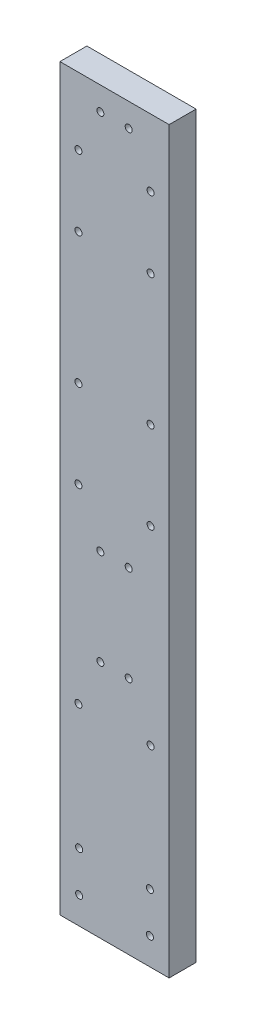
ISO-10303-21;
HEADER;
FILE_DESCRIPTION(('STEP AP214'),'2;1');
FILE_NAME('part.step','',(''),(''),'','','');
FILE_SCHEMA(('AUTOMOTIVE_DESIGN { 1 0 10303 214 1 1 1 1 }'));
ENDSEC;
DATA;
#1=APPLICATION_CONTEXT('core data for automotive mechanical design processes');
#2=APPLICATION_PROTOCOL_DEFINITION('international standard','automotive_design',2000,#1);
#3=PRODUCT_CONTEXT('',#1,'mechanical');
#4=PRODUCT('Part','Part','',(#3));
#5=PRODUCT_RELATED_PRODUCT_CATEGORY('part','',(#4));
#6=PRODUCT_DEFINITION_FORMATION('','',#4);
#7=PRODUCT_DEFINITION_CONTEXT('part definition',#1,'design');
#8=PRODUCT_DEFINITION('design','',#6,#7);
#9=PRODUCT_DEFINITION_SHAPE('','',#8);
#10=(LENGTH_UNIT() NAMED_UNIT(*) SI_UNIT(.MILLI.,.METRE.));
#11=(NAMED_UNIT(*) PLANE_ANGLE_UNIT() SI_UNIT($,.RADIAN.));
#12=(NAMED_UNIT(*) SI_UNIT($,.STERADIAN.) SOLID_ANGLE_UNIT());
#13=UNCERTAINTY_MEASURE_WITH_UNIT(LENGTH_MEASURE(1.E-05),#10,'distance_accuracy_value','');
#14=(GEOMETRIC_REPRESENTATION_CONTEXT(3) GLOBAL_UNCERTAINTY_ASSIGNED_CONTEXT((#13)) GLOBAL_UNIT_ASSIGNED_CONTEXT((#10,
#11,#12)) REPRESENTATION_CONTEXT('',''));
#15=CARTESIAN_POINT('',(0.,0.,0.));
#16=DIRECTION('',(0.,0.,1.));
#17=DIRECTION('',(1.,0.,0.));
#18=AXIS2_PLACEMENT_3D('',#15,#16,#17);
#19=CARTESIAN_POINT('',(0.,0.,4.));
#20=DIRECTION('',(0.,0.,1.));
#21=DIRECTION('',(1.,0.,0.));
#22=AXIS2_PLACEMENT_3D('',#19,#20,#21);
#23=PLANE('',#22);
#24=CARTESIAN_POINT('',(13.35,10.,4.));
#25=DIRECTION('',(0.,0.,1.));
#26=DIRECTION('',(-1.,0.,0.));
#27=AXIS2_PLACEMENT_3D('',#24,#25,#26);
#28=CIRCLE('',#27,0.519960121099866);
#29=CARTESIAN_POINT('',(12.8300398789001,10.,4.));
#30=VERTEX_POINT('',#29);
#31=EDGE_CURVE('E217',#30,#30,#28,.T.);
#32=ORIENTED_EDGE('',*,*,#31,.F.);
#33=EDGE_LOOP('',(#32));
#34=FACE_BOUND('',#33,.T.);
#35=CARTESIAN_POINT('',(2.85,10.,4.));
#36=DIRECTION('',(0.,0.,1.));
#37=DIRECTION('',(1.,0.,0.));
#38=AXIS2_PLACEMENT_3D('',#35,#36,#37);
#39=CIRCLE('',#38,0.519960121099865);
#40=CARTESIAN_POINT('',(3.36996012109986,10.,4.));
#41=VERTEX_POINT('',#40);
#42=EDGE_CURVE('E205',#41,#41,#39,.T.);
#43=ORIENTED_EDGE('',*,*,#42,.F.);
#44=EDGE_LOOP('',(#43));
#45=FACE_BOUND('',#44,.T.);
#46=CARTESIAN_POINT('',(2.74999999999998,69.71,4.));
#47=DIRECTION('',(0.,0.,1.));
#48=DIRECTION('',(1.,0.,0.));
#49=AXIS2_PLACEMENT_3D('',#46,#47,#48);
#50=CIRCLE('',#49,0.519960121099858);
#51=CARTESIAN_POINT('',(3.26996012109984,69.71,4.));
#52=VERTEX_POINT('',#51);
#53=EDGE_CURVE('E193',#52,#52,#50,.T.);
#54=ORIENTED_EDGE('',*,*,#53,.F.);
#55=EDGE_LOOP('',(#54));
#56=FACE_BOUND('',#55,.T.);
#57=CARTESIAN_POINT('',(2.74999999999999,56.71,4.));
#58=DIRECTION('',(0.,0.,1.));
#59=DIRECTION('',(1.,0.,0.));
#60=AXIS2_PLACEMENT_3D('',#57,#58,#59);
#61=CIRCLE('',#60,0.519960121099858);
#62=CARTESIAN_POINT('',(3.26996012109985,56.71,4.));
#63=VERTEX_POINT('',#62);
#64=EDGE_CURVE('E181',#63,#63,#61,.T.);
#65=ORIENTED_EDGE('',*,*,#64,.F.);
#66=EDGE_LOOP('',(#65));
#67=FACE_BOUND('',#66,.T.);
#68=CARTESIAN_POINT('',(10.2,106.16,4.));
#69=DIRECTION('',(0.,0.,1.));
#70=DIRECTION('',(-1.,0.,0.));
#71=AXIS2_PLACEMENT_3D('',#68,#69,#70);
#72=CIRCLE('',#71,0.519960121099869);
#73=CARTESIAN_POINT('',(9.68003987890012,106.16,4.));
#74=VERTEX_POINT('',#73);
#75=EDGE_CURVE('E169',#74,#74,#72,.T.);
#76=ORIENTED_EDGE('',*,*,#75,.F.);
#77=EDGE_LOOP('',(#76));
#78=FACE_BOUND('',#77,.T.);
#79=CARTESIAN_POINT('',(2.74999999999998,89.16,4.));
#80=DIRECTION('',(0.,0.,1.));
#81=DIRECTION('',(-1.,0.,0.));
#82=AXIS2_PLACEMENT_3D('',#79,#80,#81);
#83=CIRCLE('',#82,0.51996012109986);
#84=CARTESIAN_POINT('',(2.23003987890013,89.16,4.));
#85=VERTEX_POINT('',#84);
#86=EDGE_CURVE('E157',#85,#85,#83,.T.);
#87=ORIENTED_EDGE('',*,*,#86,.F.);
#88=EDGE_LOOP('',(#87));
#89=FACE_BOUND('',#88,.T.);
#90=CARTESIAN_POINT('',(2.75,28.5,4.));
#91=DIRECTION('',(0.,0.,1.));
#92=DIRECTION('',(1.,0.,0.));
#93=AXIS2_PLACEMENT_3D('',#90,#91,#92);
#94=CIRCLE('',#93,0.519960121099867);
#95=CARTESIAN_POINT('',(3.26996012109986,28.5,4.));
#96=VERTEX_POINT('',#95);
#97=EDGE_CURVE('E145',#96,#96,#94,.T.);
#98=ORIENTED_EDGE('',*,*,#97,.F.);
#99=EDGE_LOOP('',(#98));
#100=FACE_BOUND('',#99,.T.);
#101=CARTESIAN_POINT('',(6.,35.5,4.));
#102=DIRECTION('',(0.,0.,1.));
#103=DIRECTION('',(1.,0.,0.));
#104=AXIS2_PLACEMENT_3D('',#101,#102,#103);
#105=CIRCLE('',#104,0.51996012109988);
#106=CARTESIAN_POINT('',(6.51996012109988,35.5,4.));
#107=VERTEX_POINT('',#106);
#108=EDGE_CURVE('E133',#107,#107,#105,.T.);
#109=ORIENTED_EDGE('',*,*,#108,.F.);
#110=EDGE_LOOP('',(#109));
#111=FACE_BOUND('',#110,.T.);
#112=CARTESIAN_POINT('',(5.99999999999999,49.71,4.));
#113=DIRECTION('',(0.,0.,1.));
#114=DIRECTION('',(1.,0.,0.));
#115=AXIS2_PLACEMENT_3D('',#112,#113,#114);
#116=CIRCLE('',#115,0.519960121099861);
#117=CARTESIAN_POINT('',(6.51996012109985,49.71,4.));
#118=VERTEX_POINT('',#117);
#119=EDGE_CURVE('E121',#118,#118,#116,.T.);
#120=ORIENTED_EDGE('',*,*,#119,.F.);
#121=EDGE_LOOP('',(#120));
#122=FACE_BOUND('',#121,.T.);
#123=CARTESIAN_POINT('',(5.99999999999999,106.16,4.));
#124=DIRECTION('',(0.,0.,1.));
#125=DIRECTION('',(1.,0.,0.));
#126=AXIS2_PLACEMENT_3D('',#123,#124,#125);
#127=CIRCLE('',#126,0.519960121099861);
#128=CARTESIAN_POINT('',(6.51996012109985,106.16,4.));
#129=VERTEX_POINT('',#128);
#130=EDGE_CURVE('E100',#129,#129,#127,.T.);
#131=ORIENTED_EDGE('',*,*,#130,.F.);
#132=EDGE_LOOP('',(#131));
#133=FACE_BOUND('',#132,.T.);
#134=DIRECTION('',(0.,-1.,0.));
#135=VECTOR('',#134,1.);
#136=CARTESIAN_POINT('',(0.,109.64,4.));
#137=LINE('',#136,#135);
#138=CARTESIAN_POINT('',(0.,109.64,4.));
#139=VERTEX_POINT('',#138);
#140=CARTESIAN_POINT('',(0.,0.,4.));
#141=VERTEX_POINT('',#140);
#142=EDGE_CURVE('E85',#139,#141,#137,.T.);
#143=ORIENTED_EDGE('',*,*,#142,.T.);
#144=DIRECTION('',(1.,0.,0.));
#145=VECTOR('',#144,1.);
#146=CARTESIAN_POINT('',(0.,0.,4.));
#147=LINE('',#146,#145);
#148=CARTESIAN_POINT('',(16.2,0.,4.));
#149=VERTEX_POINT('',#148);
#150=EDGE_CURVE('E80',#141,#149,#147,.T.);
#151=ORIENTED_EDGE('',*,*,#150,.T.);
#152=DIRECTION('',(0.,1.,0.));
#153=VECTOR('',#152,1.);
#154=CARTESIAN_POINT('',(16.2,0.,4.));
#155=LINE('',#154,#153);
#156=CARTESIAN_POINT('',(16.2,109.64,4.));
#157=VERTEX_POINT('',#156);
#158=EDGE_CURVE('E83',#149,#157,#155,.T.);
#159=ORIENTED_EDGE('',*,*,#158,.T.);
#160=DIRECTION('',(-1.,0.,0.));
#161=VECTOR('',#160,1.);
#162=CARTESIAN_POINT('',(16.2,109.64,4.));
#163=LINE('',#162,#161);
#164=EDGE_CURVE('E50',#157,#139,#163,.T.);
#165=ORIENTED_EDGE('',*,*,#164,.T.);
#166=EDGE_LOOP('',(#143,#151,#159,#165));
#167=FACE_BOUND('',#166,.T.);
#168=CARTESIAN_POINT('',(10.2,49.71,4.));
#169=DIRECTION('',(0.,0.,1.));
#170=DIRECTION('',(1.,0.,0.));
#171=AXIS2_PLACEMENT_3D('',#168,#169,#170);
#172=CIRCLE('',#171,0.519960121099864);
#173=CARTESIAN_POINT('',(10.7199601210999,49.71,4.));
#174=VERTEX_POINT('',#173);
#175=EDGE_CURVE('E115',#174,#174,#172,.T.);
#176=ORIENTED_EDGE('',*,*,#175,.F.);
#177=EDGE_LOOP('',(#176));
#178=FACE_BOUND('',#177,.T.);
#179=CARTESIAN_POINT('',(10.2,35.5,4.));
#180=DIRECTION('',(0.,0.,1.));
#181=DIRECTION('',(1.,0.,0.));
#182=AXIS2_PLACEMENT_3D('',#179,#180,#181);
#183=CIRCLE('',#182,0.519960121099865);
#184=CARTESIAN_POINT('',(10.7199601210999,35.5,4.));
#185=VERTEX_POINT('',#184);
#186=EDGE_CURVE('E127',#185,#185,#183,.T.);
#187=ORIENTED_EDGE('',*,*,#186,.F.);
#188=EDGE_LOOP('',(#187));
#189=FACE_BOUND('',#188,.T.);
#190=CARTESIAN_POINT('',(13.45,28.5,4.));
#191=DIRECTION('',(0.,0.,1.));
#192=DIRECTION('',(1.,0.,0.));
#193=AXIS2_PLACEMENT_3D('',#190,#191,#192);
#194=CIRCLE('',#193,0.519960121099865);
#195=CARTESIAN_POINT('',(13.9699601210999,28.5,4.));
#196=VERTEX_POINT('',#195);
#197=EDGE_CURVE('E139',#196,#196,#194,.T.);
#198=ORIENTED_EDGE('',*,*,#197,.F.);
#199=EDGE_LOOP('',(#198));
#200=FACE_BOUND('',#199,.T.);
#201=CARTESIAN_POINT('',(13.45,56.71,4.));
#202=DIRECTION('',(0.,0.,1.));
#203=DIRECTION('',(1.,0.,0.));
#204=AXIS2_PLACEMENT_3D('',#201,#202,#203);
#205=CIRCLE('',#204,0.519960121099861);
#206=CARTESIAN_POINT('',(13.9699601210999,56.71,4.));
#207=VERTEX_POINT('',#206);
#208=EDGE_CURVE('E151',#207,#207,#205,.T.);
#209=ORIENTED_EDGE('',*,*,#208,.F.);
#210=EDGE_LOOP('',(#209));
#211=FACE_BOUND('',#210,.T.);
#212=CARTESIAN_POINT('',(13.45,89.16,4.));
#213=DIRECTION('',(0.,0.,1.));
#214=DIRECTION('',(-1.,0.,0.));
#215=AXIS2_PLACEMENT_3D('',#212,#213,#214);
#216=CIRCLE('',#215,0.519960121099861);
#217=CARTESIAN_POINT('',(12.9300398789001,89.16,4.));
#218=VERTEX_POINT('',#217);
#219=EDGE_CURVE('E163',#218,#218,#216,.T.);
#220=ORIENTED_EDGE('',*,*,#219,.F.);
#221=EDGE_LOOP('',(#220));
#222=FACE_BOUND('',#221,.T.);
#223=CARTESIAN_POINT('',(13.45,99.66,4.));
#224=DIRECTION('',(0.,0.,1.));
#225=DIRECTION('',(-1.,0.,0.));
#226=AXIS2_PLACEMENT_3D('',#223,#224,#225);
#227=CIRCLE('',#226,0.519960121099862);
#228=CARTESIAN_POINT('',(12.9300398789001,99.66,4.));
#229=VERTEX_POINT('',#228);
#230=EDGE_CURVE('E175',#229,#229,#227,.T.);
#231=ORIENTED_EDGE('',*,*,#230,.F.);
#232=EDGE_LOOP('',(#231));
#233=FACE_BOUND('',#232,.T.);
#234=CARTESIAN_POINT('',(13.45,69.71,4.));
#235=DIRECTION('',(0.,0.,1.));
#236=DIRECTION('',(1.,0.,0.));
#237=AXIS2_PLACEMENT_3D('',#234,#235,#236);
#238=CIRCLE('',#237,0.519960121099861);
#239=CARTESIAN_POINT('',(13.9699601210999,69.71,4.));
#240=VERTEX_POINT('',#239);
#241=EDGE_CURVE('E187',#240,#240,#238,.T.);
#242=ORIENTED_EDGE('',*,*,#241,.F.);
#243=EDGE_LOOP('',(#242));
#244=FACE_BOUND('',#243,.T.);
#245=CARTESIAN_POINT('',(2.74999999999999,99.66,4.));
#246=DIRECTION('',(0.,0.,1.));
#247=DIRECTION('',(1.,0.,0.));
#248=AXIS2_PLACEMENT_3D('',#245,#246,#247);
#249=CIRCLE('',#248,0.51996012109986);
#250=CARTESIAN_POINT('',(3.26996012109985,99.66,4.));
#251=VERTEX_POINT('',#250);
#252=EDGE_CURVE('E199',#251,#251,#249,.T.);
#253=ORIENTED_EDGE('',*,*,#252,.F.);
#254=EDGE_LOOP('',(#253));
#255=FACE_BOUND('',#254,.T.);
#256=CARTESIAN_POINT('',(2.85,4.,4.));
#257=DIRECTION('',(0.,0.,1.));
#258=DIRECTION('',(1.,0.,0.));
#259=AXIS2_PLACEMENT_3D('',#256,#257,#258);
#260=CIRCLE('',#259,0.519960121099865);
#261=CARTESIAN_POINT('',(3.36996012109986,4.,4.));
#262=VERTEX_POINT('',#261);
#263=EDGE_CURVE('E211',#262,#262,#260,.T.);
#264=ORIENTED_EDGE('',*,*,#263,.F.);
#265=EDGE_LOOP('',(#264));
#266=FACE_BOUND('',#265,.T.);
#267=CARTESIAN_POINT('',(13.35,4.,4.));
#268=DIRECTION('',(0.,0.,1.));
#269=DIRECTION('',(-1.,0.,0.));
#270=AXIS2_PLACEMENT_3D('',#267,#268,#269);
#271=CIRCLE('',#270,0.519960121099866);
#272=CARTESIAN_POINT('',(12.8300398789001,4.,4.));
#273=VERTEX_POINT('',#272);
#274=EDGE_CURVE('E223',#273,#273,#271,.T.);
#275=ORIENTED_EDGE('',*,*,#274,.F.);
#276=EDGE_LOOP('',(#275));
#277=FACE_BOUND('',#276,.T.);
#278=ADVANCED_FACE('F33',(#34,#45,#56,#67,#78,#89,#100,#111,#122,#133,#167,#178,#189,#200,#211,
#222,#233,#244,#255,#266,#277),#23,.T.);
#279=CARTESIAN_POINT('',(0.,0.,0.));
#280=DIRECTION('',(0.,0.,1.));
#281=DIRECTION('',(1.,0.,0.));
#282=AXIS2_PLACEMENT_3D('',#279,#280,#281);
#283=PLANE('',#282);
#284=CARTESIAN_POINT('',(13.35,10.,0.));
#285=DIRECTION('',(0.,0.,1.));
#286=DIRECTION('',(-1.,0.,0.));
#287=AXIS2_PLACEMENT_3D('',#284,#285,#286);
#288=CIRCLE('',#287,0.519960121099866);
#289=CARTESIAN_POINT('',(12.8300398789001,10.,0.));
#290=VERTEX_POINT('',#289);
#291=EDGE_CURVE('E220',#290,#290,#288,.T.);
#292=ORIENTED_EDGE('',*,*,#291,.T.);
#293=EDGE_LOOP('',(#292));
#294=FACE_BOUND('',#293,.T.);
#295=CARTESIAN_POINT('',(2.85,10.,0.));
#296=DIRECTION('',(0.,0.,1.));
#297=DIRECTION('',(1.,0.,0.));
#298=AXIS2_PLACEMENT_3D('',#295,#296,#297);
#299=CIRCLE('',#298,0.519960121099865);
#300=CARTESIAN_POINT('',(3.36996012109986,10.,0.));
#301=VERTEX_POINT('',#300);
#302=EDGE_CURVE('E208',#301,#301,#299,.T.);
#303=ORIENTED_EDGE('',*,*,#302,.T.);
#304=EDGE_LOOP('',(#303));
#305=FACE_BOUND('',#304,.T.);
#306=CARTESIAN_POINT('',(2.74999999999998,69.71,0.));
#307=DIRECTION('',(0.,0.,1.));
#308=DIRECTION('',(1.,0.,0.));
#309=AXIS2_PLACEMENT_3D('',#306,#307,#308);
#310=CIRCLE('',#309,0.519960121099858);
#311=CARTESIAN_POINT('',(3.26996012109984,69.71,0.));
#312=VERTEX_POINT('',#311);
#313=EDGE_CURVE('E196',#312,#312,#310,.T.);
#314=ORIENTED_EDGE('',*,*,#313,.T.);
#315=EDGE_LOOP('',(#314));
#316=FACE_BOUND('',#315,.T.);
#317=CARTESIAN_POINT('',(2.74999999999999,56.71,0.));
#318=DIRECTION('',(0.,0.,1.));
#319=DIRECTION('',(1.,0.,0.));
#320=AXIS2_PLACEMENT_3D('',#317,#318,#319);
#321=CIRCLE('',#320,0.519960121099858);
#322=CARTESIAN_POINT('',(3.26996012109985,56.71,0.));
#323=VERTEX_POINT('',#322);
#324=EDGE_CURVE('E184',#323,#323,#321,.T.);
#325=ORIENTED_EDGE('',*,*,#324,.T.);
#326=EDGE_LOOP('',(#325));
#327=FACE_BOUND('',#326,.T.);
#328=CARTESIAN_POINT('',(10.2,106.16,0.));
#329=DIRECTION('',(0.,0.,1.));
#330=DIRECTION('',(-1.,0.,0.));
#331=AXIS2_PLACEMENT_3D('',#328,#329,#330);
#332=CIRCLE('',#331,0.519960121099869);
#333=CARTESIAN_POINT('',(9.68003987890012,106.16,0.));
#334=VERTEX_POINT('',#333);
#335=EDGE_CURVE('E172',#334,#334,#332,.T.);
#336=ORIENTED_EDGE('',*,*,#335,.T.);
#337=EDGE_LOOP('',(#336));
#338=FACE_BOUND('',#337,.T.);
#339=CARTESIAN_POINT('',(2.74999999999998,89.16,0.));
#340=DIRECTION('',(0.,0.,1.));
#341=DIRECTION('',(-1.,0.,0.));
#342=AXIS2_PLACEMENT_3D('',#339,#340,#341);
#343=CIRCLE('',#342,0.51996012109986);
#344=CARTESIAN_POINT('',(2.23003987890013,89.16,0.));
#345=VERTEX_POINT('',#344);
#346=EDGE_CURVE('E160',#345,#345,#343,.T.);
#347=ORIENTED_EDGE('',*,*,#346,.T.);
#348=EDGE_LOOP('',(#347));
#349=FACE_BOUND('',#348,.T.);
#350=CARTESIAN_POINT('',(2.75,28.5,0.));
#351=DIRECTION('',(0.,0.,1.));
#352=DIRECTION('',(1.,0.,0.));
#353=AXIS2_PLACEMENT_3D('',#350,#351,#352);
#354=CIRCLE('',#353,0.519960121099867);
#355=CARTESIAN_POINT('',(3.26996012109986,28.5,0.));
#356=VERTEX_POINT('',#355);
#357=EDGE_CURVE('E148',#356,#356,#354,.T.);
#358=ORIENTED_EDGE('',*,*,#357,.T.);
#359=EDGE_LOOP('',(#358));
#360=FACE_BOUND('',#359,.T.);
#361=CARTESIAN_POINT('',(6.,35.5,0.));
#362=DIRECTION('',(0.,0.,1.));
#363=DIRECTION('',(1.,0.,0.));
#364=AXIS2_PLACEMENT_3D('',#361,#362,#363);
#365=CIRCLE('',#364,0.51996012109988);
#366=CARTESIAN_POINT('',(6.51996012109988,35.5,0.));
#367=VERTEX_POINT('',#366);
#368=EDGE_CURVE('E136',#367,#367,#365,.T.);
#369=ORIENTED_EDGE('',*,*,#368,.T.);
#370=EDGE_LOOP('',(#369));
#371=FACE_BOUND('',#370,.T.);
#372=CARTESIAN_POINT('',(5.99999999999999,49.71,0.));
#373=DIRECTION('',(0.,0.,1.));
#374=DIRECTION('',(1.,0.,0.));
#375=AXIS2_PLACEMENT_3D('',#372,#373,#374);
#376=CIRCLE('',#375,0.519960121099861);
#377=CARTESIAN_POINT('',(6.51996012109985,49.71,0.));
#378=VERTEX_POINT('',#377);
#379=EDGE_CURVE('E124',#378,#378,#376,.T.);
#380=ORIENTED_EDGE('',*,*,#379,.T.);
#381=EDGE_LOOP('',(#380));
#382=FACE_BOUND('',#381,.T.);
#383=CARTESIAN_POINT('',(5.99999999999999,106.16,0.));
#384=DIRECTION('',(0.,0.,1.));
#385=DIRECTION('',(1.,0.,0.));
#386=AXIS2_PLACEMENT_3D('',#383,#384,#385);
#387=CIRCLE('',#386,0.519960121099861);
#388=CARTESIAN_POINT('',(6.51996012109985,106.16,0.));
#389=VERTEX_POINT('',#388);
#390=EDGE_CURVE('E112',#389,#389,#387,.T.);
#391=ORIENTED_EDGE('',*,*,#390,.T.);
#392=EDGE_LOOP('',(#391));
#393=FACE_BOUND('',#392,.T.);
#394=DIRECTION('',(0.,-1.,0.));
#395=VECTOR('',#394,1.);
#396=CARTESIAN_POINT('',(0.,109.64,0.));
#397=LINE('',#396,#395);
#398=CARTESIAN_POINT('',(0.,109.64,0.));
#399=VERTEX_POINT('',#398);
#400=CARTESIAN_POINT('',(0.,0.,0.));
#401=VERTEX_POINT('',#400);
#402=EDGE_CURVE('E97',#399,#401,#397,.T.);
#403=ORIENTED_EDGE('',*,*,#402,.F.);
#404=DIRECTION('',(-1.,0.,0.));
#405=VECTOR('',#404,1.);
#406=CARTESIAN_POINT('',(16.2,109.64,0.));
#407=LINE('',#406,#405);
#408=CARTESIAN_POINT('',(16.2,109.64,0.));
#409=VERTEX_POINT('',#408);
#410=EDGE_CURVE('E73',#409,#399,#407,.T.);
#411=ORIENTED_EDGE('',*,*,#410,.F.);
#412=DIRECTION('',(0.,1.,0.));
#413=VECTOR('',#412,1.);
#414=CARTESIAN_POINT('',(16.2,0.,0.));
#415=LINE('',#414,#413);
#416=CARTESIAN_POINT('',(16.2,0.,0.));
#417=VERTEX_POINT('',#416);
#418=EDGE_CURVE('E67',#417,#409,#415,.T.);
#419=ORIENTED_EDGE('',*,*,#418,.F.);
#420=DIRECTION('',(1.,0.,0.));
#421=VECTOR('',#420,1.);
#422=CARTESIAN_POINT('',(0.,0.,0.));
#423=LINE('',#422,#421);
#424=EDGE_CURVE('E89',#401,#417,#423,.T.);
#425=ORIENTED_EDGE('',*,*,#424,.F.);
#426=EDGE_LOOP('',(#403,#411,#419,#425));
#427=FACE_BOUND('',#426,.T.);
#428=CARTESIAN_POINT('',(10.2,49.71,0.));
#429=DIRECTION('',(0.,0.,1.));
#430=DIRECTION('',(1.,0.,0.));
#431=AXIS2_PLACEMENT_3D('',#428,#429,#430);
#432=CIRCLE('',#431,0.519960121099864);
#433=CARTESIAN_POINT('',(10.7199601210999,49.71,0.));
#434=VERTEX_POINT('',#433);
#435=EDGE_CURVE('E118',#434,#434,#432,.T.);
#436=ORIENTED_EDGE('',*,*,#435,.T.);
#437=EDGE_LOOP('',(#436));
#438=FACE_BOUND('',#437,.T.);
#439=CARTESIAN_POINT('',(10.2,35.5,0.));
#440=DIRECTION('',(0.,0.,1.));
#441=DIRECTION('',(1.,0.,0.));
#442=AXIS2_PLACEMENT_3D('',#439,#440,#441);
#443=CIRCLE('',#442,0.519960121099865);
#444=CARTESIAN_POINT('',(10.7199601210999,35.5,0.));
#445=VERTEX_POINT('',#444);
#446=EDGE_CURVE('E130',#445,#445,#443,.T.);
#447=ORIENTED_EDGE('',*,*,#446,.T.);
#448=EDGE_LOOP('',(#447));
#449=FACE_BOUND('',#448,.T.);
#450=CARTESIAN_POINT('',(13.45,28.5,0.));
#451=DIRECTION('',(0.,0.,1.));
#452=DIRECTION('',(1.,0.,0.));
#453=AXIS2_PLACEMENT_3D('',#450,#451,#452);
#454=CIRCLE('',#453,0.519960121099865);
#455=CARTESIAN_POINT('',(13.9699601210999,28.5,0.));
#456=VERTEX_POINT('',#455);
#457=EDGE_CURVE('E142',#456,#456,#454,.T.);
#458=ORIENTED_EDGE('',*,*,#457,.T.);
#459=EDGE_LOOP('',(#458));
#460=FACE_BOUND('',#459,.T.);
#461=CARTESIAN_POINT('',(13.45,56.71,0.));
#462=DIRECTION('',(0.,0.,1.));
#463=DIRECTION('',(1.,0.,0.));
#464=AXIS2_PLACEMENT_3D('',#461,#462,#463);
#465=CIRCLE('',#464,0.519960121099861);
#466=CARTESIAN_POINT('',(13.9699601210999,56.71,0.));
#467=VERTEX_POINT('',#466);
#468=EDGE_CURVE('E154',#467,#467,#465,.T.);
#469=ORIENTED_EDGE('',*,*,#468,.T.);
#470=EDGE_LOOP('',(#469));
#471=FACE_BOUND('',#470,.T.);
#472=CARTESIAN_POINT('',(13.45,89.16,0.));
#473=DIRECTION('',(0.,0.,1.));
#474=DIRECTION('',(-1.,0.,0.));
#475=AXIS2_PLACEMENT_3D('',#472,#473,#474);
#476=CIRCLE('',#475,0.519960121099861);
#477=CARTESIAN_POINT('',(12.9300398789001,89.16,0.));
#478=VERTEX_POINT('',#477);
#479=EDGE_CURVE('E166',#478,#478,#476,.T.);
#480=ORIENTED_EDGE('',*,*,#479,.T.);
#481=EDGE_LOOP('',(#480));
#482=FACE_BOUND('',#481,.T.);
#483=CARTESIAN_POINT('',(13.45,99.66,0.));
#484=DIRECTION('',(0.,0.,1.));
#485=DIRECTION('',(-1.,0.,0.));
#486=AXIS2_PLACEMENT_3D('',#483,#484,#485);
#487=CIRCLE('',#486,0.519960121099862);
#488=CARTESIAN_POINT('',(12.9300398789001,99.66,0.));
#489=VERTEX_POINT('',#488);
#490=EDGE_CURVE('E178',#489,#489,#487,.T.);
#491=ORIENTED_EDGE('',*,*,#490,.T.);
#492=EDGE_LOOP('',(#491));
#493=FACE_BOUND('',#492,.T.);
#494=CARTESIAN_POINT('',(13.45,69.71,0.));
#495=DIRECTION('',(0.,0.,1.));
#496=DIRECTION('',(1.,0.,0.));
#497=AXIS2_PLACEMENT_3D('',#494,#495,#496);
#498=CIRCLE('',#497,0.519960121099861);
#499=CARTESIAN_POINT('',(13.9699601210999,69.71,0.));
#500=VERTEX_POINT('',#499);
#501=EDGE_CURVE('E190',#500,#500,#498,.T.);
#502=ORIENTED_EDGE('',*,*,#501,.T.);
#503=EDGE_LOOP('',(#502));
#504=FACE_BOUND('',#503,.T.);
#505=CARTESIAN_POINT('',(2.74999999999999,99.66,0.));
#506=DIRECTION('',(0.,0.,1.));
#507=DIRECTION('',(1.,0.,0.));
#508=AXIS2_PLACEMENT_3D('',#505,#506,#507);
#509=CIRCLE('',#508,0.51996012109986);
#510=CARTESIAN_POINT('',(3.26996012109985,99.66,0.));
#511=VERTEX_POINT('',#510);
#512=EDGE_CURVE('E202',#511,#511,#509,.T.);
#513=ORIENTED_EDGE('',*,*,#512,.T.);
#514=EDGE_LOOP('',(#513));
#515=FACE_BOUND('',#514,.T.);
#516=CARTESIAN_POINT('',(2.85,4.,0.));
#517=DIRECTION('',(0.,0.,1.));
#518=DIRECTION('',(1.,0.,0.));
#519=AXIS2_PLACEMENT_3D('',#516,#517,#518);
#520=CIRCLE('',#519,0.519960121099865);
#521=CARTESIAN_POINT('',(3.36996012109986,4.,0.));
#522=VERTEX_POINT('',#521);
#523=EDGE_CURVE('E214',#522,#522,#520,.T.);
#524=ORIENTED_EDGE('',*,*,#523,.T.);
#525=EDGE_LOOP('',(#524));
#526=FACE_BOUND('',#525,.T.);
#527=CARTESIAN_POINT('',(13.35,4.,0.));
#528=DIRECTION('',(0.,0.,1.));
#529=DIRECTION('',(-1.,0.,0.));
#530=AXIS2_PLACEMENT_3D('',#527,#528,#529);
#531=CIRCLE('',#530,0.519960121099866);
#532=CARTESIAN_POINT('',(12.8300398789001,4.,0.));
#533=VERTEX_POINT('',#532);
#534=EDGE_CURVE('E226',#533,#533,#531,.T.);
#535=ORIENTED_EDGE('',*,*,#534,.T.);
#536=EDGE_LOOP('',(#535));
#537=FACE_BOUND('',#536,.T.);
#538=ADVANCED_FACE('F108',(#294,#305,#316,#327,#338,#349,#360,#371,#382,#393,#427,#438,#449,
#460,#471,#482,#493,#504,#515,#526,#537),#283,.F.);
#539=CARTESIAN_POINT('',(0.,109.64,4.));
#540=DIRECTION('',(1.,0.,0.));
#541=DIRECTION('',(0.,1.,0.));
#542=AXIS2_PLACEMENT_3D('',#539,#540,#541);
#543=PLANE('',#542);
#544=ORIENTED_EDGE('',*,*,#402,.T.);
#545=DIRECTION('',(0.,0.,-1.));
#546=VECTOR('',#545,1.);
#547=CARTESIAN_POINT('',(0.,0.,4.));
#548=LINE('',#547,#546);
#549=EDGE_CURVE('E11',#141,#401,#548,.T.);
#550=ORIENTED_EDGE('',*,*,#549,.F.);
#551=ORIENTED_EDGE('',*,*,#142,.F.);
#552=DIRECTION('',(0.,0.,-1.));
#553=VECTOR('',#552,1.);
#554=CARTESIAN_POINT('',(0.,109.64,4.));
#555=LINE('',#554,#553);
#556=EDGE_CURVE('E93',#139,#399,#555,.T.);
#557=ORIENTED_EDGE('',*,*,#556,.T.);
#558=EDGE_LOOP('',(#544,#550,#551,#557));
#559=FACE_BOUND('',#558,.T.);
#560=ADVANCED_FACE('F35',(#559),#543,.F.);
#561=CARTESIAN_POINT('',(0.,0.,4.));
#562=DIRECTION('',(0.,1.,0.));
#563=DIRECTION('',(-1.,0.,0.));
#564=AXIS2_PLACEMENT_3D('',#561,#562,#563);
#565=PLANE('',#564);
#566=ORIENTED_EDGE('',*,*,#424,.T.);
#567=DIRECTION('',(0.,0.,-1.));
#568=VECTOR('',#567,1.);
#569=CARTESIAN_POINT('',(16.2,0.,4.));
#570=LINE('',#569,#568);
#571=EDGE_CURVE('E42',#149,#417,#570,.T.);
#572=ORIENTED_EDGE('',*,*,#571,.F.);
#573=ORIENTED_EDGE('',*,*,#150,.F.);
#574=ORIENTED_EDGE('',*,*,#549,.T.);
#575=EDGE_LOOP('',(#566,#572,#573,#574));
#576=FACE_BOUND('',#575,.T.);
#577=ADVANCED_FACE('F88',(#576),#565,.F.);
#578=CARTESIAN_POINT('',(16.2,0.,4.));
#579=DIRECTION('',(-1.,0.,0.));
#580=DIRECTION('',(0.,-1.,0.));
#581=AXIS2_PLACEMENT_3D('',#578,#579,#580);
#582=PLANE('',#581);
#583=ORIENTED_EDGE('',*,*,#418,.T.);
#584=DIRECTION('',(0.,0.,-1.));
#585=VECTOR('',#584,1.);
#586=CARTESIAN_POINT('',(16.2,109.64,4.));
#587=LINE('',#586,#585);
#588=EDGE_CURVE('E90',#157,#409,#587,.T.);
#589=ORIENTED_EDGE('',*,*,#588,.F.);
#590=ORIENTED_EDGE('',*,*,#158,.F.);
#591=ORIENTED_EDGE('',*,*,#571,.T.);
#592=EDGE_LOOP('',(#583,#589,#590,#591));
#593=FACE_BOUND('',#592,.T.);
#594=ADVANCED_FACE('F91',(#593),#582,.F.);
#595=CARTESIAN_POINT('',(16.2,109.64,4.));
#596=DIRECTION('',(0.,-1.,0.));
#597=DIRECTION('',(0.,0.,-1.));
#598=AXIS2_PLACEMENT_3D('',#595,#596,#597);
#599=PLANE('',#598);
#600=ORIENTED_EDGE('',*,*,#410,.T.);
#601=ORIENTED_EDGE('',*,*,#556,.F.);
#602=ORIENTED_EDGE('',*,*,#164,.F.);
#603=ORIENTED_EDGE('',*,*,#588,.T.);
#604=EDGE_LOOP('',(#600,#601,#602,#603));
#605=FACE_BOUND('',#604,.T.);
#606=ADVANCED_FACE('F105',(#605),#599,.F.);
#607=CARTESIAN_POINT('',(5.99999999999999,106.16,4.));
#608=DIRECTION('',(0.,0.,-1.));
#609=DIRECTION('',(-1.,0.,0.));
#610=AXIS2_PLACEMENT_3D('',#607,#608,#609);
#611=CYLINDRICAL_SURFACE('',#610,0.519960121099861);
#612=ORIENTED_EDGE('',*,*,#130,.T.);
#613=EDGE_LOOP('',(#612));
#614=FACE_BOUND('',#613,.T.);
#615=ORIENTED_EDGE('',*,*,#390,.F.);
#616=EDGE_LOOP('',(#615));
#617=FACE_BOUND('',#616,.T.);
#618=ADVANCED_FACE('F246',(#614,#617),#611,.F.);
#619=CARTESIAN_POINT('',(10.2,49.71,4.));
#620=DIRECTION('',(0.,0.,-1.));
#621=DIRECTION('',(-1.,0.,0.));
#622=AXIS2_PLACEMENT_3D('',#619,#620,#621);
#623=CYLINDRICAL_SURFACE('',#622,0.519960121099864);
#624=ORIENTED_EDGE('',*,*,#175,.T.);
#625=EDGE_LOOP('',(#624));
#626=FACE_BOUND('',#625,.T.);
#627=ORIENTED_EDGE('',*,*,#435,.F.);
#628=EDGE_LOOP('',(#627));
#629=FACE_BOUND('',#628,.T.);
#630=ADVANCED_FACE('F292',(#626,#629),#623,.F.);
#631=CARTESIAN_POINT('',(5.99999999999999,49.71,4.));
#632=DIRECTION('',(0.,0.,-1.));
#633=DIRECTION('',(-1.,0.,0.));
#634=AXIS2_PLACEMENT_3D('',#631,#632,#633);
#635=CYLINDRICAL_SURFACE('',#634,0.519960121099861);
#636=ORIENTED_EDGE('',*,*,#119,.T.);
#637=EDGE_LOOP('',(#636));
#638=FACE_BOUND('',#637,.T.);
#639=ORIENTED_EDGE('',*,*,#379,.F.);
#640=EDGE_LOOP('',(#639));
#641=FACE_BOUND('',#640,.T.);
#642=ADVANCED_FACE('F300',(#638,#641),#635,.F.);
#643=CARTESIAN_POINT('',(10.2,35.5,4.));
#644=DIRECTION('',(0.,0.,-1.));
#645=DIRECTION('',(-1.,0.,0.));
#646=AXIS2_PLACEMENT_3D('',#643,#644,#645);
#647=CYLINDRICAL_SURFACE('',#646,0.519960121099865);
#648=ORIENTED_EDGE('',*,*,#186,.T.);
#649=EDGE_LOOP('',(#648));
#650=FACE_BOUND('',#649,.T.);
#651=ORIENTED_EDGE('',*,*,#446,.F.);
#652=EDGE_LOOP('',(#651));
#653=FACE_BOUND('',#652,.T.);
#654=ADVANCED_FACE('F308',(#650,#653),#647,.F.);
#655=CARTESIAN_POINT('',(6.,35.5,4.));
#656=DIRECTION('',(0.,0.,-1.));
#657=DIRECTION('',(-1.,0.,0.));
#658=AXIS2_PLACEMENT_3D('',#655,#656,#657);
#659=CYLINDRICAL_SURFACE('',#658,0.51996012109988);
#660=ORIENTED_EDGE('',*,*,#108,.T.);
#661=EDGE_LOOP('',(#660));
#662=FACE_BOUND('',#661,.T.);
#663=ORIENTED_EDGE('',*,*,#368,.F.);
#664=EDGE_LOOP('',(#663));
#665=FACE_BOUND('',#664,.T.);
#666=ADVANCED_FACE('F317',(#662,#665),#659,.F.);
#667=CARTESIAN_POINT('',(13.45,28.5,4.));
#668=DIRECTION('',(0.,0.,-1.));
#669=DIRECTION('',(-1.,0.,0.));
#670=AXIS2_PLACEMENT_3D('',#667,#668,#669);
#671=CYLINDRICAL_SURFACE('',#670,0.519960121099865);
#672=ORIENTED_EDGE('',*,*,#197,.T.);
#673=EDGE_LOOP('',(#672));
#674=FACE_BOUND('',#673,.T.);
#675=ORIENTED_EDGE('',*,*,#457,.F.);
#676=EDGE_LOOP('',(#675));
#677=FACE_BOUND('',#676,.T.);
#678=ADVANCED_FACE('F326',(#674,#677),#671,.F.);
#679=CARTESIAN_POINT('',(2.75,28.5,4.));
#680=DIRECTION('',(0.,0.,-1.));
#681=DIRECTION('',(-1.,0.,0.));
#682=AXIS2_PLACEMENT_3D('',#679,#680,#681);
#683=CYLINDRICAL_SURFACE('',#682,0.519960121099867);
#684=ORIENTED_EDGE('',*,*,#97,.T.);
#685=EDGE_LOOP('',(#684));
#686=FACE_BOUND('',#685,.T.);
#687=ORIENTED_EDGE('',*,*,#357,.F.);
#688=EDGE_LOOP('',(#687));
#689=FACE_BOUND('',#688,.T.);
#690=ADVANCED_FACE('F335',(#686,#689),#683,.F.);
#691=CARTESIAN_POINT('',(13.45,56.71,4.));
#692=DIRECTION('',(0.,0.,-1.));
#693=DIRECTION('',(-1.,0.,0.));
#694=AXIS2_PLACEMENT_3D('',#691,#692,#693);
#695=CYLINDRICAL_SURFACE('',#694,0.519960121099861);
#696=ORIENTED_EDGE('',*,*,#208,.T.);
#697=EDGE_LOOP('',(#696));
#698=FACE_BOUND('',#697,.T.);
#699=ORIENTED_EDGE('',*,*,#468,.F.);
#700=EDGE_LOOP('',(#699));
#701=FACE_BOUND('',#700,.T.);
#702=ADVANCED_FACE('F344',(#698,#701),#695,.F.);
#703=CARTESIAN_POINT('',(2.74999999999998,89.16,4.));
#704=DIRECTION('',(0.,0.,-1.));
#705=DIRECTION('',(-1.,0.,0.));
#706=AXIS2_PLACEMENT_3D('',#703,#704,#705);
#707=CYLINDRICAL_SURFACE('',#706,0.51996012109986);
#708=ORIENTED_EDGE('',*,*,#86,.T.);
#709=EDGE_LOOP('',(#708));
#710=FACE_BOUND('',#709,.T.);
#711=ORIENTED_EDGE('',*,*,#346,.F.);
#712=EDGE_LOOP('',(#711));
#713=FACE_BOUND('',#712,.T.);
#714=ADVANCED_FACE('F353',(#710,#713),#707,.F.);
#715=CARTESIAN_POINT('',(13.45,89.16,4.));
#716=DIRECTION('',(0.,0.,-1.));
#717=DIRECTION('',(-1.,0.,0.));
#718=AXIS2_PLACEMENT_3D('',#715,#716,#717);
#719=CYLINDRICAL_SURFACE('',#718,0.519960121099861);
#720=ORIENTED_EDGE('',*,*,#219,.T.);
#721=EDGE_LOOP('',(#720));
#722=FACE_BOUND('',#721,.T.);
#723=ORIENTED_EDGE('',*,*,#479,.F.);
#724=EDGE_LOOP('',(#723));
#725=FACE_BOUND('',#724,.T.);
#726=ADVANCED_FACE('F362',(#722,#725),#719,.F.);
#727=CARTESIAN_POINT('',(10.2,106.16,4.));
#728=DIRECTION('',(0.,0.,-1.));
#729=DIRECTION('',(-1.,0.,0.));
#730=AXIS2_PLACEMENT_3D('',#727,#728,#729);
#731=CYLINDRICAL_SURFACE('',#730,0.519960121099869);
#732=ORIENTED_EDGE('',*,*,#75,.T.);
#733=EDGE_LOOP('',(#732));
#734=FACE_BOUND('',#733,.T.);
#735=ORIENTED_EDGE('',*,*,#335,.F.);
#736=EDGE_LOOP('',(#735));
#737=FACE_BOUND('',#736,.T.);
#738=ADVANCED_FACE('F371',(#734,#737),#731,.F.);
#739=CARTESIAN_POINT('',(13.45,99.66,4.));
#740=DIRECTION('',(0.,0.,-1.));
#741=DIRECTION('',(-1.,0.,0.));
#742=AXIS2_PLACEMENT_3D('',#739,#740,#741);
#743=CYLINDRICAL_SURFACE('',#742,0.519960121099862);
#744=ORIENTED_EDGE('',*,*,#230,.T.);
#745=EDGE_LOOP('',(#744));
#746=FACE_BOUND('',#745,.T.);
#747=ORIENTED_EDGE('',*,*,#490,.F.);
#748=EDGE_LOOP('',(#747));
#749=FACE_BOUND('',#748,.T.);
#750=ADVANCED_FACE('F380',(#746,#749),#743,.F.);
#751=CARTESIAN_POINT('',(2.74999999999999,56.71,4.));
#752=DIRECTION('',(0.,0.,-1.));
#753=DIRECTION('',(-1.,0.,0.));
#754=AXIS2_PLACEMENT_3D('',#751,#752,#753);
#755=CYLINDRICAL_SURFACE('',#754,0.519960121099858);
#756=ORIENTED_EDGE('',*,*,#64,.T.);
#757=EDGE_LOOP('',(#756));
#758=FACE_BOUND('',#757,.T.);
#759=ORIENTED_EDGE('',*,*,#324,.F.);
#760=EDGE_LOOP('',(#759));
#761=FACE_BOUND('',#760,.T.);
#762=ADVANCED_FACE('F389',(#758,#761),#755,.F.);
#763=CARTESIAN_POINT('',(13.45,69.71,4.));
#764=DIRECTION('',(0.,0.,-1.));
#765=DIRECTION('',(-1.,0.,0.));
#766=AXIS2_PLACEMENT_3D('',#763,#764,#765);
#767=CYLINDRICAL_SURFACE('',#766,0.519960121099861);
#768=ORIENTED_EDGE('',*,*,#241,.T.);
#769=EDGE_LOOP('',(#768));
#770=FACE_BOUND('',#769,.T.);
#771=ORIENTED_EDGE('',*,*,#501,.F.);
#772=EDGE_LOOP('',(#771));
#773=FACE_BOUND('',#772,.T.);
#774=ADVANCED_FACE('F398',(#770,#773),#767,.F.);
#775=CARTESIAN_POINT('',(2.74999999999998,69.71,4.));
#776=DIRECTION('',(0.,0.,-1.));
#777=DIRECTION('',(-1.,0.,0.));
#778=AXIS2_PLACEMENT_3D('',#775,#776,#777);
#779=CYLINDRICAL_SURFACE('',#778,0.519960121099858);
#780=ORIENTED_EDGE('',*,*,#53,.T.);
#781=EDGE_LOOP('',(#780));
#782=FACE_BOUND('',#781,.T.);
#783=ORIENTED_EDGE('',*,*,#313,.F.);
#784=EDGE_LOOP('',(#783));
#785=FACE_BOUND('',#784,.T.);
#786=ADVANCED_FACE('F407',(#782,#785),#779,.F.);
#787=CARTESIAN_POINT('',(2.74999999999999,99.66,4.));
#788=DIRECTION('',(0.,0.,-1.));
#789=DIRECTION('',(-1.,0.,0.));
#790=AXIS2_PLACEMENT_3D('',#787,#788,#789);
#791=CYLINDRICAL_SURFACE('',#790,0.51996012109986);
#792=ORIENTED_EDGE('',*,*,#252,.T.);
#793=EDGE_LOOP('',(#792));
#794=FACE_BOUND('',#793,.T.);
#795=ORIENTED_EDGE('',*,*,#512,.F.);
#796=EDGE_LOOP('',(#795));
#797=FACE_BOUND('',#796,.T.);
#798=ADVANCED_FACE('F416',(#794,#797),#791,.F.);
#799=CARTESIAN_POINT('',(2.85,10.,4.));
#800=DIRECTION('',(0.,0.,-1.));
#801=DIRECTION('',(-1.,0.,0.));
#802=AXIS2_PLACEMENT_3D('',#799,#800,#801);
#803=CYLINDRICAL_SURFACE('',#802,0.519960121099865);
#804=ORIENTED_EDGE('',*,*,#42,.T.);
#805=EDGE_LOOP('',(#804));
#806=FACE_BOUND('',#805,.T.);
#807=ORIENTED_EDGE('',*,*,#302,.F.);
#808=EDGE_LOOP('',(#807));
#809=FACE_BOUND('',#808,.T.);
#810=ADVANCED_FACE('F425',(#806,#809),#803,.F.);
#811=CARTESIAN_POINT('',(2.85,4.,4.));
#812=DIRECTION('',(0.,0.,-1.));
#813=DIRECTION('',(-1.,0.,0.));
#814=AXIS2_PLACEMENT_3D('',#811,#812,#813);
#815=CYLINDRICAL_SURFACE('',#814,0.519960121099865);
#816=ORIENTED_EDGE('',*,*,#263,.T.);
#817=EDGE_LOOP('',(#816));
#818=FACE_BOUND('',#817,.T.);
#819=ORIENTED_EDGE('',*,*,#523,.F.);
#820=EDGE_LOOP('',(#819));
#821=FACE_BOUND('',#820,.T.);
#822=ADVANCED_FACE('F434',(#818,#821),#815,.F.);
#823=CARTESIAN_POINT('',(13.35,10.,4.));
#824=DIRECTION('',(0.,0.,-1.));
#825=DIRECTION('',(-1.,0.,0.));
#826=AXIS2_PLACEMENT_3D('',#823,#824,#825);
#827=CYLINDRICAL_SURFACE('',#826,0.519960121099866);
#828=ORIENTED_EDGE('',*,*,#31,.T.);
#829=EDGE_LOOP('',(#828));
#830=FACE_BOUND('',#829,.T.);
#831=ORIENTED_EDGE('',*,*,#291,.F.);
#832=EDGE_LOOP('',(#831));
#833=FACE_BOUND('',#832,.T.);
#834=ADVANCED_FACE('F443',(#830,#833),#827,.F.);
#835=CARTESIAN_POINT('',(13.35,4.,4.));
#836=DIRECTION('',(0.,0.,-1.));
#837=DIRECTION('',(-1.,0.,0.));
#838=AXIS2_PLACEMENT_3D('',#835,#836,#837);
#839=CYLINDRICAL_SURFACE('',#838,0.519960121099866);
#840=ORIENTED_EDGE('',*,*,#274,.T.);
#841=EDGE_LOOP('',(#840));
#842=FACE_BOUND('',#841,.T.);
#843=ORIENTED_EDGE('',*,*,#534,.F.);
#844=EDGE_LOOP('',(#843));
#845=FACE_BOUND('',#844,.T.);
#846=ADVANCED_FACE('F232',(#842,#845),#839,.F.);
#847=CLOSED_SHELL('',(#278,#538,#560,#577,#594,#606,#618,#630,#642,#654,#666,#678,#690,#702,
#714,#726,#738,#750,#762,#774,#786,#798,#810,#822,#834,#846));
#848=MANIFOLD_SOLID_BREP('B2',#847);
#849=ADVANCED_BREP_SHAPE_REPRESENTATION('',(#18,#848),#14);
#850=SHAPE_DEFINITION_REPRESENTATION(#9,#849);
ENDSEC;
END-ISO-10303-21;
